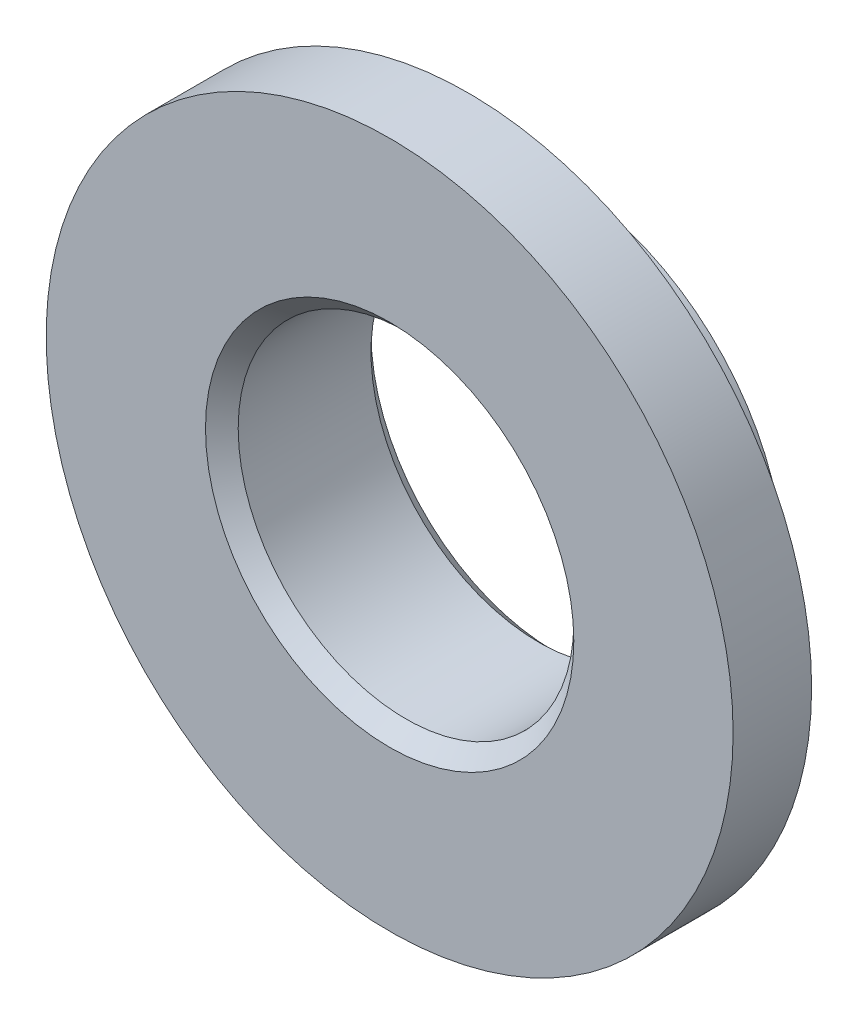
ISO-10303-21;
HEADER;
FILE_DESCRIPTION(('STEP AP214'),'2;1');
FILE_NAME('part.step','',(''),(''),'','','');
FILE_SCHEMA(('AUTOMOTIVE_DESIGN { 1 0 10303 214 1 1 1 1 }'));
ENDSEC;
DATA;
#1=APPLICATION_CONTEXT('core data for automotive mechanical design processes');
#2=APPLICATION_PROTOCOL_DEFINITION('international standard','automotive_design',2000,#1);
#3=PRODUCT_CONTEXT('',#1,'mechanical');
#4=PRODUCT('Part','Part','',(#3));
#5=PRODUCT_RELATED_PRODUCT_CATEGORY('part','',(#4));
#6=PRODUCT_DEFINITION_FORMATION('','',#4);
#7=PRODUCT_DEFINITION_CONTEXT('part definition',#1,'design');
#8=PRODUCT_DEFINITION('design','',#6,#7);
#9=PRODUCT_DEFINITION_SHAPE('','',#8);
#10=(LENGTH_UNIT() NAMED_UNIT(*) SI_UNIT(.MILLI.,.METRE.));
#11=(NAMED_UNIT(*) PLANE_ANGLE_UNIT() SI_UNIT($,.RADIAN.));
#12=(NAMED_UNIT(*) SI_UNIT($,.STERADIAN.) SOLID_ANGLE_UNIT());
#13=UNCERTAINTY_MEASURE_WITH_UNIT(LENGTH_MEASURE(1.E-05),#10,'distance_accuracy_value','');
#14=(GEOMETRIC_REPRESENTATION_CONTEXT(3) GLOBAL_UNCERTAINTY_ASSIGNED_CONTEXT((#13)) GLOBAL_UNIT_ASSIGNED_CONTEXT((#10,
#11,#12)) REPRESENTATION_CONTEXT('',''));
#15=CARTESIAN_POINT('',(0.,0.,0.));
#16=DIRECTION('',(0.,0.,1.));
#17=DIRECTION('',(1.,0.,0.));
#18=AXIS2_PLACEMENT_3D('',#15,#16,#17);
#19=CARTESIAN_POINT('',(0.,0.,0.));
#20=DIRECTION('',(0.,0.,1.));
#21=DIRECTION('',(1.,0.,0.));
#22=AXIS2_PLACEMENT_3D('',#19,#20,#21);
#23=CYLINDRICAL_SURFACE('',#22,10.5);
#24=CARTESIAN_POINT('',(0.,0.,0.));
#25=DIRECTION('',(0.,0.,1.));
#26=DIRECTION('',(1.,0.,0.));
#27=AXIS2_PLACEMENT_3D('',#24,#25,#26);
#28=CIRCLE('',#27,10.5);
#29=CARTESIAN_POINT('',(10.5,0.,0.));
#30=VERTEX_POINT('',#29);
#31=EDGE_CURVE('E53',#30,#30,#28,.T.);
#32=ORIENTED_EDGE('',*,*,#31,.F.);
#33=EDGE_LOOP('',(#32));
#34=FACE_BOUND('',#33,.T.);
#35=CARTESIAN_POINT('',(0.,0.,-2.4));
#36=DIRECTION('',(0.,0.,1.));
#37=DIRECTION('',(1.,0.,0.));
#38=AXIS2_PLACEMENT_3D('',#35,#36,#37);
#39=CIRCLE('',#38,10.5);
#40=CARTESIAN_POINT('',(10.5,0.,-2.4));
#41=VERTEX_POINT('',#40);
#42=EDGE_CURVE('E62',#41,#41,#39,.T.);
#43=ORIENTED_EDGE('',*,*,#42,.T.);
#44=EDGE_LOOP('',(#43));
#45=FACE_BOUND('',#44,.T.);
#46=ADVANCED_FACE('F33',(#34,#45),#23,.T.);
#47=CARTESIAN_POINT('',(0.,10.5,0.));
#48=DIRECTION('',(0.,0.,-1.));
#49=DIRECTION('',(-1.,0.,0.));
#50=AXIS2_PLACEMENT_3D('',#47,#48,#49);
#51=PLANE('',#50);
#52=CARTESIAN_POINT('',(0.,0.,0.));
#53=DIRECTION('',(0.,0.,-1.));
#54=DIRECTION('',(-1.,0.,0.));
#55=AXIS2_PLACEMENT_3D('',#52,#53,#54);
#56=CIRCLE('',#55,5.63);
#57=CARTESIAN_POINT('',(-5.63,0.,0.));
#58=VERTEX_POINT('',#57);
#59=EDGE_CURVE('E44',#58,#58,#56,.T.);
#60=ORIENTED_EDGE('',*,*,#59,.T.);
#61=EDGE_LOOP('',(#60));
#62=FACE_BOUND('',#61,.T.);
#63=ORIENTED_EDGE('',*,*,#31,.T.);
#64=EDGE_LOOP('',(#63));
#65=FACE_BOUND('',#64,.T.);
#66=ADVANCED_FACE('F87',(#62,#65),#51,.F.);
#67=CARTESIAN_POINT('',(0.,0.,0.));
#68=DIRECTION('',(0.,0.,1.));
#69=DIRECTION('',(1.,0.,0.));
#70=AXIS2_PLACEMENT_3D('',#67,#68,#69);
#71=CYLINDRICAL_SURFACE('',#70,5.13);
#72=CARTESIAN_POINT('',(0.,0.,-4.56));
#73=DIRECTION('',(0.,0.,1.));
#74=DIRECTION('',(1.,0.,0.));
#75=AXIS2_PLACEMENT_3D('',#72,#73,#74);
#76=CIRCLE('',#75,5.13);
#77=CARTESIAN_POINT('',(5.13,0.,-4.56));
#78=VERTEX_POINT('',#77);
#79=EDGE_CURVE('E10',#78,#78,#76,.F.);
#80=ORIENTED_EDGE('',*,*,#79,.T.);
#81=EDGE_LOOP('',(#80));
#82=FACE_BOUND('',#81,.T.);
#83=CARTESIAN_POINT('',(0.,0.,-0.500000000000001));
#84=DIRECTION('',(0.,0.,-1.));
#85=DIRECTION('',(-1.,0.,0.));
#86=AXIS2_PLACEMENT_3D('',#83,#84,#85);
#87=CIRCLE('',#86,5.13);
#88=CARTESIAN_POINT('',(-5.13,0.,-0.500000000000001));
#89=VERTEX_POINT('',#88);
#90=EDGE_CURVE('E48',#89,#89,#87,.F.);
#91=ORIENTED_EDGE('',*,*,#90,.T.);
#92=EDGE_LOOP('',(#91));
#93=FACE_BOUND('',#92,.T.);
#94=ADVANCED_FACE('F82',(#82,#93),#71,.F.);
#95=CARTESIAN_POINT('',(0.,5.13,-5.06));
#96=DIRECTION('',(0.,0.,1.));
#97=DIRECTION('',(1.,0.,0.));
#98=AXIS2_PLACEMENT_3D('',#95,#96,#97);
#99=PLANE('',#98);
#100=CARTESIAN_POINT('',(0.,0.,-5.06));
#101=DIRECTION('',(0.,0.,1.));
#102=DIRECTION('',(1.,0.,0.));
#103=AXIS2_PLACEMENT_3D('',#100,#101,#102);
#104=CIRCLE('',#103,5.63);
#105=CARTESIAN_POINT('',(5.63,0.,-5.06));
#106=VERTEX_POINT('',#105);
#107=EDGE_CURVE('E40',#106,#106,#104,.T.);
#108=ORIENTED_EDGE('',*,*,#107,.T.);
#109=EDGE_LOOP('',(#108));
#110=FACE_BOUND('',#109,.T.);
#111=CARTESIAN_POINT('',(0.,0.,-5.06));
#112=DIRECTION('',(0.,0.,1.));
#113=DIRECTION('',(1.,0.,0.));
#114=AXIS2_PLACEMENT_3D('',#111,#112,#113);
#115=CIRCLE('',#114,7.);
#116=CARTESIAN_POINT('',(7.,0.,-5.06));
#117=VERTEX_POINT('',#116);
#118=EDGE_CURVE('E56',#117,#117,#115,.T.);
#119=ORIENTED_EDGE('',*,*,#118,.F.);
#120=EDGE_LOOP('',(#119));
#121=FACE_BOUND('',#120,.T.);
#122=ADVANCED_FACE('F77',(#110,#121),#99,.F.);
#123=CARTESIAN_POINT('',(0.,0.,0.));
#124=DIRECTION('',(0.,0.,1.));
#125=DIRECTION('',(1.,0.,0.));
#126=AXIS2_PLACEMENT_3D('',#123,#124,#125);
#127=CYLINDRICAL_SURFACE('',#126,7.);
#128=CARTESIAN_POINT('',(0.,0.,-2.4));
#129=DIRECTION('',(0.,0.,1.));
#130=DIRECTION('',(1.,0.,0.));
#131=AXIS2_PLACEMENT_3D('',#128,#129,#130);
#132=CIRCLE('',#131,7.);
#133=CARTESIAN_POINT('',(7.,0.,-2.4));
#134=VERTEX_POINT('',#133);
#135=EDGE_CURVE('E59',#134,#134,#132,.T.);
#136=ORIENTED_EDGE('',*,*,#135,.F.);
#137=EDGE_LOOP('',(#136));
#138=FACE_BOUND('',#137,.T.);
#139=ORIENTED_EDGE('',*,*,#118,.T.);
#140=EDGE_LOOP('',(#139));
#141=FACE_BOUND('',#140,.T.);
#142=ADVANCED_FACE('F71',(#138,#141),#127,.T.);
#143=CARTESIAN_POINT('',(0.,7.,-2.4));
#144=DIRECTION('',(0.,0.,1.));
#145=DIRECTION('',(1.,0.,0.));
#146=AXIS2_PLACEMENT_3D('',#143,#144,#145);
#147=PLANE('',#146);
#148=ORIENTED_EDGE('',*,*,#42,.F.);
#149=EDGE_LOOP('',(#148));
#150=FACE_BOUND('',#149,.T.);
#151=ORIENTED_EDGE('',*,*,#135,.T.);
#152=EDGE_LOOP('',(#151));
#153=FACE_BOUND('',#152,.T.);
#154=ADVANCED_FACE('F67',(#150,#153),#147,.F.);
#155=CARTESIAN_POINT('',(0.,0.,-0.500000000000001));
#156=DIRECTION('',(0.,0.,1.));
#157=DIRECTION('',(1.,0.,0.));
#158=AXIS2_PLACEMENT_3D('',#155,#156,#157);
#159=CONICAL_SURFACE('',#158,5.13,0.785398163397451);
#160=ORIENTED_EDGE('',*,*,#59,.F.);
#161=EDGE_LOOP('',(#160));
#162=FACE_BOUND('',#161,.T.);
#163=ORIENTED_EDGE('',*,*,#90,.F.);
#164=EDGE_LOOP('',(#163));
#165=FACE_BOUND('',#164,.T.);
#166=ADVANCED_FACE('F70',(#162,#165),#159,.F.);
#167=CARTESIAN_POINT('',(0.,0.,-5.06));
#168=DIRECTION('',(0.,0.,-1.));
#169=DIRECTION('',(-1.,0.,0.));
#170=AXIS2_PLACEMENT_3D('',#167,#168,#169);
#171=CONICAL_SURFACE('',#170,5.63,0.785398163397445);
#172=ORIENTED_EDGE('',*,*,#79,.F.);
#173=EDGE_LOOP('',(#172));
#174=FACE_BOUND('',#173,.T.);
#175=ORIENTED_EDGE('',*,*,#107,.F.);
#176=EDGE_LOOP('',(#175));
#177=FACE_BOUND('',#176,.T.);
#178=ADVANCED_FACE('F35',(#174,#177),#171,.F.);
#179=CLOSED_SHELL('',(#46,#66,#94,#122,#142,#154,#166,#178));
#180=MANIFOLD_SOLID_BREP('B2',#179);
#181=ADVANCED_BREP_SHAPE_REPRESENTATION('',(#18,#180),#14);
#182=SHAPE_DEFINITION_REPRESENTATION(#9,#181);
ENDSEC;
END-ISO-10303-21;
